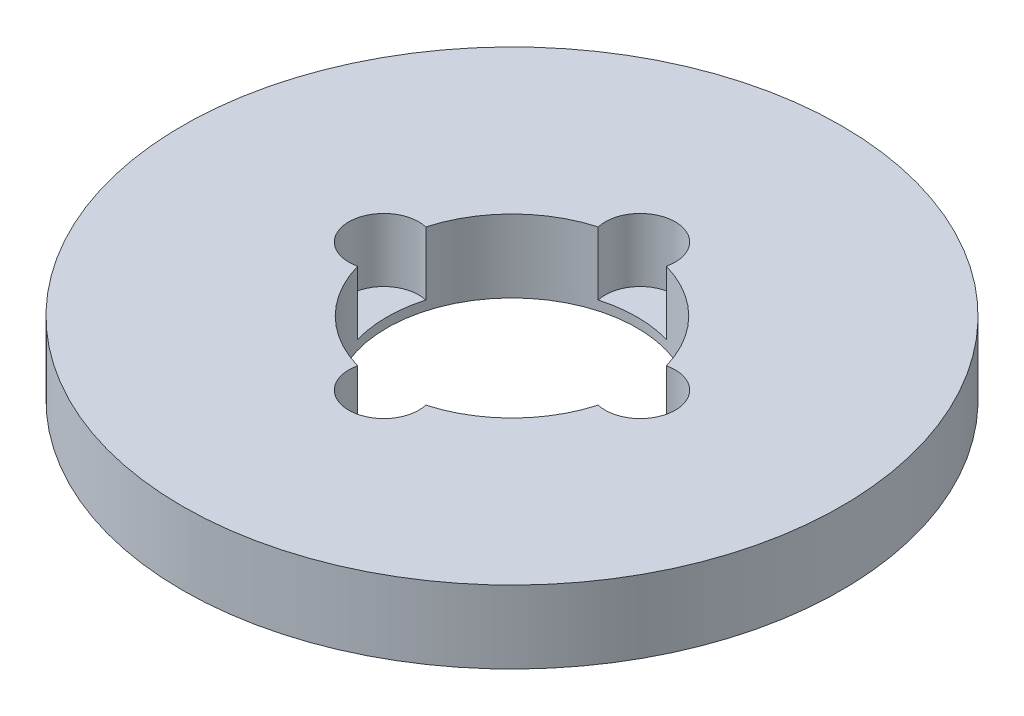
ISO-10303-21;
HEADER;
FILE_DESCRIPTION(('STEP AP214'),'2;1');
FILE_NAME('part.step','',(''),(''),'','','');
FILE_SCHEMA(('AUTOMOTIVE_DESIGN { 1 0 10303 214 1 1 1 1 }'));
ENDSEC;
DATA;
#1=APPLICATION_CONTEXT('core data for automotive mechanical design processes');
#2=APPLICATION_PROTOCOL_DEFINITION('international standard','automotive_design',2000,#1);
#3=PRODUCT_CONTEXT('',#1,'mechanical');
#4=PRODUCT('Part','Part','',(#3));
#5=PRODUCT_RELATED_PRODUCT_CATEGORY('part','',(#4));
#6=PRODUCT_DEFINITION_FORMATION('','',#4);
#7=PRODUCT_DEFINITION_CONTEXT('part definition',#1,'design');
#8=PRODUCT_DEFINITION('design','',#6,#7);
#9=PRODUCT_DEFINITION_SHAPE('','',#8);
#10=(LENGTH_UNIT() NAMED_UNIT(*) SI_UNIT(.MILLI.,.METRE.));
#11=(NAMED_UNIT(*) PLANE_ANGLE_UNIT() SI_UNIT($,.RADIAN.));
#12=(NAMED_UNIT(*) SI_UNIT($,.STERADIAN.) SOLID_ANGLE_UNIT());
#13=UNCERTAINTY_MEASURE_WITH_UNIT(LENGTH_MEASURE(1.E-05),#10,'distance_accuracy_value','');
#14=(GEOMETRIC_REPRESENTATION_CONTEXT(3) GLOBAL_UNCERTAINTY_ASSIGNED_CONTEXT((#13)) GLOBAL_UNIT_ASSIGNED_CONTEXT((#10,
#11,#12)) REPRESENTATION_CONTEXT('',''));
#15=CARTESIAN_POINT('',(0.,0.,0.));
#16=DIRECTION('',(0.,0.,1.));
#17=DIRECTION('',(1.,0.,0.));
#18=AXIS2_PLACEMENT_3D('',#15,#16,#17);
#19=CARTESIAN_POINT('',(0.,16.,0.));
#20=DIRECTION('',(0.,-1.,0.));
#21=DIRECTION('',(0.,0.,-1.));
#22=AXIS2_PLACEMENT_3D('',#19,#20,#21);
#23=CYLINDRICAL_SURFACE('',#22,72.5);
#24=CARTESIAN_POINT('',(0.,16.,0.));
#25=DIRECTION('',(0.,1.,0.));
#26=DIRECTION('',(0.,0.,1.));
#27=AXIS2_PLACEMENT_3D('',#24,#25,#26);
#28=CIRCLE('',#27,72.5);
#29=CARTESIAN_POINT('',(0.,16.,72.5));
#30=VERTEX_POINT('',#29);
#31=EDGE_CURVE('E145',#30,#30,#28,.T.);
#32=ORIENTED_EDGE('',*,*,#31,.F.);
#33=EDGE_LOOP('',(#32));
#34=FACE_BOUND('',#33,.T.);
#35=CARTESIAN_POINT('',(0.,0.,0.));
#36=DIRECTION('',(0.,1.,0.));
#37=DIRECTION('',(0.,0.,1.));
#38=AXIS2_PLACEMENT_3D('',#35,#36,#37);
#39=CIRCLE('',#38,72.5);
#40=CARTESIAN_POINT('',(0.,0.,72.5));
#41=VERTEX_POINT('',#40);
#42=EDGE_CURVE('E143',#41,#41,#39,.T.);
#43=ORIENTED_EDGE('',*,*,#42,.T.);
#44=EDGE_LOOP('',(#43));
#45=FACE_BOUND('',#44,.T.);
#46=ADVANCED_FACE('F39',(#34,#45),#23,.T.);
#47=CARTESIAN_POINT('',(0.,16.,0.));
#48=DIRECTION('',(0.,1.,0.));
#49=DIRECTION('',(0.,0.,1.));
#50=AXIS2_PLACEMENT_3D('',#47,#48,#49);
#51=PLANE('',#50);
#52=CARTESIAN_POINT('',(0.,16.,28.2119430118336));
#53=DIRECTION('',(0.,1.,0.));
#54=DIRECTION('',(1.,0.,0.));
#55=AXIS2_PLACEMENT_3D('',#52,#53,#54);
#56=CIRCLE('',#55,7.69356885435501);
#57=CARTESIAN_POINT('',(-7.49142794333714,16.,26.4599415602111));
#58=VERTEX_POINT('',#57);
#59=CARTESIAN_POINT('',(7.49142794333733,16.,26.4599415602111));
#60=VERTEX_POINT('',#59);
#61=EDGE_CURVE('E152',#58,#60,#56,.T.);
#62=ORIENTED_EDGE('',*,*,#61,.F.);
#63=CARTESIAN_POINT('',(0.,16.,0.));
#64=DIRECTION('',(0.,1.,0.));
#65=DIRECTION('',(0.,0.,1.));
#66=AXIS2_PLACEMENT_3D('',#63,#64,#65);
#67=CIRCLE('',#66,27.5);
#68=CARTESIAN_POINT('',(-26.4599415602111,16.,7.49142794333723));
#69=VERTEX_POINT('',#68);
#70=EDGE_CURVE('E133',#69,#58,#67,.T.);
#71=ORIENTED_EDGE('',*,*,#70,.F.);
#72=CARTESIAN_POINT('',(-28.2119430118336,16.,0.));
#73=DIRECTION('',(0.,1.,0.));
#74=DIRECTION('',(0.,0.,1.));
#75=AXIS2_PLACEMENT_3D('',#72,#73,#74);
#76=CIRCLE('',#75,7.69356885435501);
#77=CARTESIAN_POINT('',(-26.4599415602111,16.,-7.49142794333723));
#78=VERTEX_POINT('',#77);
#79=EDGE_CURVE('E128',#78,#69,#76,.T.);
#80=ORIENTED_EDGE('',*,*,#79,.F.);
#81=CARTESIAN_POINT('',(-7.49142794333751,16.,-26.459941560211));
#82=VERTEX_POINT('',#81);
#83=EDGE_CURVE('E121',#82,#78,#67,.T.);
#84=ORIENTED_EDGE('',*,*,#83,.F.);
#85=CARTESIAN_POINT('',(-2.95504417674969E-13,16.,-28.2119430118336));
#86=DIRECTION('',(0.,1.,0.));
#87=DIRECTION('',(-1.,0.,0.));
#88=AXIS2_PLACEMENT_3D('',#85,#86,#87);
#89=CIRCLE('',#88,7.69356885435501);
#90=CARTESIAN_POINT('',(7.49142794333696,16.,-26.4599415602112));
#91=VERTEX_POINT('',#90);
#92=EDGE_CURVE('E105',#91,#82,#89,.T.);
#93=ORIENTED_EDGE('',*,*,#92,.F.);
#94=CARTESIAN_POINT('',(26.4599415602111,16.,-7.49142794333723));
#95=VERTEX_POINT('',#94);
#96=EDGE_CURVE('E131',#95,#91,#67,.T.);
#97=ORIENTED_EDGE('',*,*,#96,.F.);
#98=CARTESIAN_POINT('',(28.2119430118336,16.,0.));
#99=DIRECTION('',(0.,1.,0.));
#100=DIRECTION('',(0.,0.,-1.));
#101=AXIS2_PLACEMENT_3D('',#98,#99,#100);
#102=CIRCLE('',#101,7.69356885435501);
#103=CARTESIAN_POINT('',(26.4599415602111,16.,7.49142794333723));
#104=VERTEX_POINT('',#103);
#105=EDGE_CURVE('E154',#104,#95,#102,.T.);
#106=ORIENTED_EDGE('',*,*,#105,.F.);
#107=EDGE_CURVE('E134',#60,#104,#67,.T.);
#108=ORIENTED_EDGE('',*,*,#107,.F.);
#109=EDGE_LOOP('',(#62,#71,#80,#84,#93,#97,#106,#108));
#110=FACE_BOUND('',#109,.T.);
#111=ORIENTED_EDGE('',*,*,#31,.T.);
#112=EDGE_LOOP('',(#111));
#113=FACE_BOUND('',#112,.T.);
#114=ADVANCED_FACE('F130',(#110,#113),#51,.T.);
#115=CARTESIAN_POINT('',(0.,0.,0.));
#116=DIRECTION('',(0.,1.,0.));
#117=DIRECTION('',(0.,0.,1.));
#118=AXIS2_PLACEMENT_3D('',#115,#116,#117);
#119=PLANE('',#118);
#120=CARTESIAN_POINT('',(0.,0.,0.));
#121=DIRECTION('',(0.,1.,0.));
#122=DIRECTION('',(0.,0.,1.));
#123=AXIS2_PLACEMENT_3D('',#120,#121,#122);
#124=CIRCLE('',#123,27.5);
#125=CARTESIAN_POINT('',(0.,0.,27.5));
#126=VERTEX_POINT('',#125);
#127=EDGE_CURVE('E135',#126,#126,#124,.T.);
#128=ORIENTED_EDGE('',*,*,#127,.T.);
#129=EDGE_LOOP('',(#128));
#130=FACE_BOUND('',#129,.T.);
#131=ORIENTED_EDGE('',*,*,#42,.F.);
#132=EDGE_LOOP('',(#131));
#133=FACE_BOUND('',#132,.T.);
#134=ADVANCED_FACE('F195',(#130,#133),#119,.F.);
#135=CARTESIAN_POINT('',(0.,16.,0.));
#136=DIRECTION('',(0.,-1.,0.));
#137=DIRECTION('',(0.,0.,-1.));
#138=AXIS2_PLACEMENT_3D('',#135,#136,#137);
#139=CYLINDRICAL_SURFACE('',#138,27.5);
#140=DIRECTION('',(0.,1.,0.));
#141=VECTOR('',#140,1.);
#142=CARTESIAN_POINT('',(-7.49142794333714,9.03564102176482,26.4599415602111));
#143=LINE('',#142,#141);
#144=CARTESIAN_POINT('',(-7.49142794333714,2.07128204352964,26.4599415602111));
#145=VERTEX_POINT('',#144);
#146=EDGE_CURVE('E11',#145,#58,#143,.T.);
#147=ORIENTED_EDGE('',*,*,#146,.F.);
#148=CARTESIAN_POINT('',(0.,2.07128204352964,0.));
#149=DIRECTION('',(0.,1.,0.));
#150=DIRECTION('',(0.,0.,1.));
#151=AXIS2_PLACEMENT_3D('',#148,#149,#150);
#152=CIRCLE('',#151,27.5);
#153=CARTESIAN_POINT('',(7.49142794333733,2.07128204352964,26.4599415602111));
#154=VERTEX_POINT('',#153);
#155=EDGE_CURVE('E169',#145,#154,#152,.T.);
#156=ORIENTED_EDGE('',*,*,#155,.T.);
#157=DIRECTION('',(0.,1.,0.));
#158=VECTOR('',#157,1.);
#159=CARTESIAN_POINT('',(7.49142794333733,9.03564102176482,26.4599415602111));
#160=LINE('',#159,#158);
#161=EDGE_CURVE('E46',#60,#154,#160,.F.);
#162=ORIENTED_EDGE('',*,*,#161,.F.);
#163=ORIENTED_EDGE('',*,*,#107,.T.);
#164=DIRECTION('',(0.,1.,0.));
#165=VECTOR('',#164,1.);
#166=CARTESIAN_POINT('',(26.4599415602111,9.03564102176482,7.49142794333724));
#167=LINE('',#166,#165);
#168=CARTESIAN_POINT('',(26.4599415602111,2.07128204352964,7.49142794333723));
#169=VERTEX_POINT('',#168);
#170=EDGE_CURVE('E151',#169,#104,#167,.T.);
#171=ORIENTED_EDGE('',*,*,#170,.F.);
#172=CARTESIAN_POINT('',(0.,2.07128204352964,0.));
#173=DIRECTION('',(0.,1.,0.));
#174=DIRECTION('',(0.,0.,1.));
#175=AXIS2_PLACEMENT_3D('',#172,#173,#174);
#176=CIRCLE('',#175,27.5);
#177=CARTESIAN_POINT('',(26.4599415602111,2.07128204352964,-7.49142794333723));
#178=VERTEX_POINT('',#177);
#179=EDGE_CURVE('E173',#169,#178,#176,.T.);
#180=ORIENTED_EDGE('',*,*,#179,.T.);
#181=DIRECTION('',(0.,1.,0.));
#182=VECTOR('',#181,1.);
#183=CARTESIAN_POINT('',(26.4599415602111,9.03564102176482,-7.49142794333724));
#184=LINE('',#183,#182);
#185=EDGE_CURVE('E168',#95,#178,#184,.F.);
#186=ORIENTED_EDGE('',*,*,#185,.F.);
#187=ORIENTED_EDGE('',*,*,#96,.T.);
#188=DIRECTION('',(0.,1.,0.));
#189=VECTOR('',#188,1.);
#190=CARTESIAN_POINT('',(7.49142794333696,9.03564102176482,-26.4599415602112));
#191=LINE('',#190,#189);
#192=CARTESIAN_POINT('',(7.49142794333696,2.07128204352964,-26.4599415602112));
#193=VERTEX_POINT('',#192);
#194=EDGE_CURVE('E108',#193,#91,#191,.T.);
#195=ORIENTED_EDGE('',*,*,#194,.F.);
#196=CARTESIAN_POINT('',(0.,2.07128204352964,0.));
#197=DIRECTION('',(0.,1.,0.));
#198=DIRECTION('',(0.,0.,1.));
#199=AXIS2_PLACEMENT_3D('',#196,#197,#198);
#200=CIRCLE('',#199,27.5);
#201=CARTESIAN_POINT('',(-7.49142794333751,2.07128204352964,-26.459941560211));
#202=VERTEX_POINT('',#201);
#203=EDGE_CURVE('E122',#193,#202,#200,.T.);
#204=ORIENTED_EDGE('',*,*,#203,.T.);
#205=DIRECTION('',(0.,1.,0.));
#206=VECTOR('',#205,1.);
#207=CARTESIAN_POINT('',(-7.49142794333751,9.03564102176482,-26.459941560211));
#208=LINE('',#207,#206);
#209=EDGE_CURVE('E106',#82,#202,#208,.F.);
#210=ORIENTED_EDGE('',*,*,#209,.F.);
#211=ORIENTED_EDGE('',*,*,#83,.T.);
#212=DIRECTION('',(0.,1.,0.));
#213=VECTOR('',#212,1.);
#214=CARTESIAN_POINT('',(-26.4599415602111,9.03564102176482,-7.49142794333724));
#215=LINE('',#214,#213);
#216=CARTESIAN_POINT('',(-26.4599415602111,2.07128204352964,-7.49142794333723));
#217=VERTEX_POINT('',#216);
#218=EDGE_CURVE('E177',#217,#78,#215,.T.);
#219=ORIENTED_EDGE('',*,*,#218,.F.);
#220=CARTESIAN_POINT('',(0.,2.07128204352964,0.));
#221=DIRECTION('',(0.,1.,0.));
#222=DIRECTION('',(0.,0.,1.));
#223=AXIS2_PLACEMENT_3D('',#220,#221,#222);
#224=CIRCLE('',#223,27.5);
#225=CARTESIAN_POINT('',(-26.4599415602111,2.07128204352964,7.49142794333723));
#226=VERTEX_POINT('',#225);
#227=EDGE_CURVE('E185',#217,#226,#224,.T.);
#228=ORIENTED_EDGE('',*,*,#227,.T.);
#229=DIRECTION('',(0.,1.,0.));
#230=VECTOR('',#229,1.);
#231=CARTESIAN_POINT('',(-26.4599415602111,9.03564102176482,7.49142794333724));
#232=LINE('',#231,#230);
#233=EDGE_CURVE('E179',#69,#226,#232,.F.);
#234=ORIENTED_EDGE('',*,*,#233,.F.);
#235=ORIENTED_EDGE('',*,*,#70,.T.);
#236=EDGE_LOOP('',(#147,#156,#162,#163,#171,#180,#186,#187,#195,#204,#210,#211,#219,#228,#234,#235));
#237=FACE_BOUND('',#236,.T.);
#238=ORIENTED_EDGE('',*,*,#127,.F.);
#239=EDGE_LOOP('',(#238));
#240=FACE_BOUND('',#239,.T.);
#241=ADVANCED_FACE('F117',(#237,#240),#139,.F.);
#242=CARTESIAN_POINT('',(-28.2119430118336,2.07128204352964,0.));
#243=DIRECTION('',(0.,1.,0.));
#244=DIRECTION('',(0.,0.,1.));
#245=AXIS2_PLACEMENT_3D('',#242,#243,#244);
#246=CYLINDRICAL_SURFACE('',#245,7.69356885435501);
#247=ORIENTED_EDGE('',*,*,#218,.T.);
#248=ORIENTED_EDGE('',*,*,#79,.T.);
#249=ORIENTED_EDGE('',*,*,#233,.T.);
#250=CARTESIAN_POINT('',(-28.2119430118336,2.07128204352964,0.));
#251=DIRECTION('',(0.,1.,0.));
#252=DIRECTION('',(0.,0.,1.));
#253=AXIS2_PLACEMENT_3D('',#250,#251,#252);
#254=CIRCLE('',#253,7.69356885435501);
#255=EDGE_CURVE('E140',#217,#226,#254,.T.);
#256=ORIENTED_EDGE('',*,*,#255,.F.);
#257=EDGE_LOOP('',(#247,#248,#249,#256));
#258=FACE_BOUND('',#257,.T.);
#259=ADVANCED_FACE('F200',(#258),#246,.F.);
#260=CARTESIAN_POINT('',(-28.2119430118336,2.07128204352964,0.));
#261=DIRECTION('',(0.,1.,0.));
#262=DIRECTION('',(0.,0.,1.));
#263=AXIS2_PLACEMENT_3D('',#260,#261,#262);
#264=PLANE('',#263);
#265=ORIENTED_EDGE('',*,*,#255,.T.);
#266=ORIENTED_EDGE('',*,*,#227,.F.);
#267=EDGE_LOOP('',(#265,#266));
#268=FACE_BOUND('',#267,.T.);
#269=ADVANCED_FACE('F202',(#268),#264,.T.);
#270=CARTESIAN_POINT('',(-2.95504417674969E-13,2.07128204352964,-28.2119430118336));
#271=DIRECTION('',(0.,1.,0.));
#272=DIRECTION('',(0.,0.,1.));
#273=AXIS2_PLACEMENT_3D('',#270,#271,#272);
#274=CYLINDRICAL_SURFACE('',#273,7.69356885435501);
#275=ORIENTED_EDGE('',*,*,#194,.T.);
#276=ORIENTED_EDGE('',*,*,#92,.T.);
#277=ORIENTED_EDGE('',*,*,#209,.T.);
#278=CARTESIAN_POINT('',(-2.95504417674969E-13,2.07128204352964,-28.2119430118336));
#279=DIRECTION('',(0.,1.,0.));
#280=DIRECTION('',(-1.,0.,0.));
#281=AXIS2_PLACEMENT_3D('',#278,#279,#280);
#282=CIRCLE('',#281,7.69356885435501);
#283=EDGE_CURVE('E111',#193,#202,#282,.T.);
#284=ORIENTED_EDGE('',*,*,#283,.F.);
#285=EDGE_LOOP('',(#275,#276,#277,#284));
#286=FACE_BOUND('',#285,.T.);
#287=ADVANCED_FACE('F102',(#286),#274,.F.);
#288=CARTESIAN_POINT('',(-2.95504417674969E-13,2.07128204352964,-28.2119430118336));
#289=DIRECTION('',(0.,1.,0.));
#290=DIRECTION('',(-1.,0.,0.));
#291=AXIS2_PLACEMENT_3D('',#288,#289,#290);
#292=PLANE('',#291);
#293=ORIENTED_EDGE('',*,*,#283,.T.);
#294=ORIENTED_EDGE('',*,*,#203,.F.);
#295=EDGE_LOOP('',(#293,#294));
#296=FACE_BOUND('',#295,.T.);
#297=ADVANCED_FACE('F211',(#296),#292,.T.);
#298=CARTESIAN_POINT('',(28.2119430118336,2.07128204352964,0.));
#299=DIRECTION('',(0.,1.,0.));
#300=DIRECTION('',(0.,0.,1.));
#301=AXIS2_PLACEMENT_3D('',#298,#299,#300);
#302=CYLINDRICAL_SURFACE('',#301,7.69356885435501);
#303=ORIENTED_EDGE('',*,*,#170,.T.);
#304=ORIENTED_EDGE('',*,*,#105,.T.);
#305=ORIENTED_EDGE('',*,*,#185,.T.);
#306=CARTESIAN_POINT('',(28.2119430118336,2.07128204352964,0.));
#307=DIRECTION('',(0.,1.,0.));
#308=DIRECTION('',(0.,0.,-1.));
#309=AXIS2_PLACEMENT_3D('',#306,#307,#308);
#310=CIRCLE('',#309,7.69356885435501);
#311=EDGE_CURVE('E56',#169,#178,#310,.T.);
#312=ORIENTED_EDGE('',*,*,#311,.F.);
#313=EDGE_LOOP('',(#303,#304,#305,#312));
#314=FACE_BOUND('',#313,.T.);
#315=ADVANCED_FACE('F212',(#314),#302,.F.);
#316=CARTESIAN_POINT('',(28.2119430118336,2.07128204352964,0.));
#317=DIRECTION('',(0.,1.,0.));
#318=DIRECTION('',(0.,0.,-1.));
#319=AXIS2_PLACEMENT_3D('',#316,#317,#318);
#320=PLANE('',#319);
#321=ORIENTED_EDGE('',*,*,#311,.T.);
#322=ORIENTED_EDGE('',*,*,#179,.F.);
#323=EDGE_LOOP('',(#321,#322));
#324=FACE_BOUND('',#323,.T.);
#325=ADVANCED_FACE('F217',(#324),#320,.T.);
#326=CARTESIAN_POINT('',(0.,2.07128204352964,28.2119430118336));
#327=DIRECTION('',(0.,1.,0.));
#328=DIRECTION('',(0.,0.,1.));
#329=AXIS2_PLACEMENT_3D('',#326,#327,#328);
#330=CYLINDRICAL_SURFACE('',#329,7.69356885435501);
#331=ORIENTED_EDGE('',*,*,#146,.T.);
#332=ORIENTED_EDGE('',*,*,#61,.T.);
#333=ORIENTED_EDGE('',*,*,#161,.T.);
#334=CARTESIAN_POINT('',(0.,2.07128204352964,28.2119430118336));
#335=DIRECTION('',(0.,1.,0.));
#336=DIRECTION('',(1.,0.,0.));
#337=AXIS2_PLACEMENT_3D('',#334,#335,#336);
#338=CIRCLE('',#337,7.69356885435501);
#339=EDGE_CURVE('E55',#145,#154,#338,.T.);
#340=ORIENTED_EDGE('',*,*,#339,.F.);
#341=EDGE_LOOP('',(#331,#332,#333,#340));
#342=FACE_BOUND('',#341,.T.);
#343=ADVANCED_FACE('F170',(#342),#330,.F.);
#344=CARTESIAN_POINT('',(0.,2.07128204352964,28.2119430118336));
#345=DIRECTION('',(0.,1.,0.));
#346=DIRECTION('',(1.,0.,0.));
#347=AXIS2_PLACEMENT_3D('',#344,#345,#346);
#348=PLANE('',#347);
#349=ORIENTED_EDGE('',*,*,#339,.T.);
#350=ORIENTED_EDGE('',*,*,#155,.F.);
#351=EDGE_LOOP('',(#349,#350));
#352=FACE_BOUND('',#351,.T.);
#353=ADVANCED_FACE('F224',(#352),#348,.T.);
#354=CLOSED_SHELL('',(#46,#114,#134,#241,#259,#269,#287,#297,#315,#325,#343,#353));
#355=MANIFOLD_SOLID_BREP('B2',#354);
#356=ADVANCED_BREP_SHAPE_REPRESENTATION('',(#18,#355),#14);
#357=SHAPE_DEFINITION_REPRESENTATION(#9,#356);
ENDSEC;
END-ISO-10303-21;
